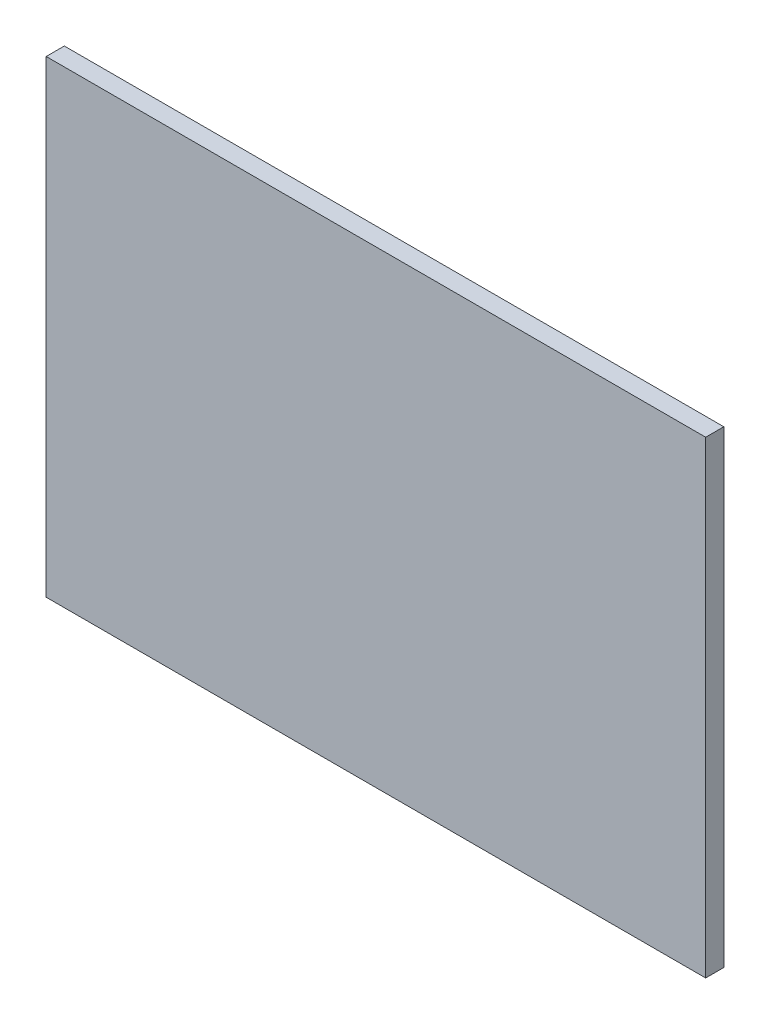
ISO-10303-21;
HEADER;
FILE_DESCRIPTION(('STEP AP214'),'2;1');
FILE_NAME('part.step','',(''),(''),'','','');
FILE_SCHEMA(('AUTOMOTIVE_DESIGN { 1 0 10303 214 1 1 1 1 }'));
ENDSEC;
DATA;
#1=APPLICATION_CONTEXT('core data for automotive mechanical design processes');
#2=APPLICATION_PROTOCOL_DEFINITION('international standard','automotive_design',2000,#1);
#3=PRODUCT_CONTEXT('',#1,'mechanical');
#4=PRODUCT('Part','Part','',(#3));
#5=PRODUCT_RELATED_PRODUCT_CATEGORY('part','',(#4));
#6=PRODUCT_DEFINITION_FORMATION('','',#4);
#7=PRODUCT_DEFINITION_CONTEXT('part definition',#1,'design');
#8=PRODUCT_DEFINITION('design','',#6,#7);
#9=PRODUCT_DEFINITION_SHAPE('','',#8);
#10=(LENGTH_UNIT() NAMED_UNIT(*) SI_UNIT(.MILLI.,.METRE.));
#11=(NAMED_UNIT(*) PLANE_ANGLE_UNIT() SI_UNIT($,.RADIAN.));
#12=(NAMED_UNIT(*) SI_UNIT($,.STERADIAN.) SOLID_ANGLE_UNIT());
#13=UNCERTAINTY_MEASURE_WITH_UNIT(LENGTH_MEASURE(1.E-05),#10,'distance_accuracy_value','');
#14=(GEOMETRIC_REPRESENTATION_CONTEXT(3) GLOBAL_UNCERTAINTY_ASSIGNED_CONTEXT((#13)) GLOBAL_UNIT_ASSIGNED_CONTEXT((#10,
#11,#12)) REPRESENTATION_CONTEXT('',''));
#15=CARTESIAN_POINT('',(0.,0.,0.));
#16=DIRECTION('',(0.,0.,1.));
#17=DIRECTION('',(1.,0.,0.));
#18=AXIS2_PLACEMENT_3D('',#15,#16,#17);
#19=CARTESIAN_POINT('',(-31.1136053155129,31.427314942792,-1.89738));
#20=DIRECTION('',(-1.,0.,0.));
#21=DIRECTION('',(0.,-1.,0.));
#22=AXIS2_PLACEMENT_3D('',#19,#20,#21);
#23=PLANE('',#22);
#24=DIRECTION('',(0.,-1.,0.));
#25=VECTOR('',#24,1.);
#26=CARTESIAN_POINT('',(-31.1136053155129,31.427314942792,0.));
#27=LINE('',#26,#25);
#28=CARTESIAN_POINT('',(-31.1136053155129,31.427314942792,0.));
#29=VERTEX_POINT('',#28);
#30=CARTESIAN_POINT('',(-31.1136053155129,-17.572685057208,0.));
#31=VERTEX_POINT('',#30);
#32=EDGE_CURVE('E99',#29,#31,#27,.T.);
#33=ORIENTED_EDGE('',*,*,#32,.F.);
#34=DIRECTION('',(0.,0.,1.));
#35=VECTOR('',#34,1.);
#36=CARTESIAN_POINT('',(-31.1136053155129,31.427314942792,-1.89738));
#37=LINE('',#36,#35);
#38=CARTESIAN_POINT('',(-31.1136053155129,31.427314942792,-1.89738));
#39=VERTEX_POINT('',#38);
#40=EDGE_CURVE('E11',#39,#29,#37,.T.);
#41=ORIENTED_EDGE('',*,*,#40,.F.);
#42=DIRECTION('',(0.,-1.,0.));
#43=VECTOR('',#42,1.);
#44=CARTESIAN_POINT('',(-31.1136053155129,31.427314942792,-1.89738));
#45=LINE('',#44,#43);
#46=CARTESIAN_POINT('',(-31.1136053155129,-17.572685057208,-1.89738));
#47=VERTEX_POINT('',#46);
#48=EDGE_CURVE('E93',#39,#47,#45,.T.);
#49=ORIENTED_EDGE('',*,*,#48,.T.);
#50=DIRECTION('',(0.,0.,1.));
#51=VECTOR('',#50,1.);
#52=CARTESIAN_POINT('',(-31.1136053155129,-17.572685057208,-1.89738));
#53=LINE('',#52,#51);
#54=EDGE_CURVE('E38',#47,#31,#53,.T.);
#55=ORIENTED_EDGE('',*,*,#54,.T.);
#56=EDGE_LOOP('',(#33,#41,#49,#55));
#57=FACE_BOUND('',#56,.T.);
#58=ADVANCED_FACE('F35',(#57),#23,.T.);
#59=CARTESIAN_POINT('',(-31.1136053155129,31.427314942792,-1.89738));
#60=DIRECTION('',(0.,1.,0.));
#61=DIRECTION('',(0.,0.,1.));
#62=AXIS2_PLACEMENT_3D('',#59,#60,#61);
#63=PLANE('',#62);
#64=DIRECTION('',(-1.,0.,0.));
#65=VECTOR('',#64,1.);
#66=CARTESIAN_POINT('',(-31.1136053155129,31.427314942792,0.));
#67=LINE('',#66,#65);
#68=CARTESIAN_POINT('',(37.8863946844871,31.427314942792,0.));
#69=VERTEX_POINT('',#68);
#70=EDGE_CURVE('E95',#69,#29,#67,.T.);
#71=ORIENTED_EDGE('',*,*,#70,.F.);
#72=DIRECTION('',(0.,0.,1.));
#73=VECTOR('',#72,1.);
#74=CARTESIAN_POINT('',(37.8863946844871,31.427314942792,-1.89738));
#75=LINE('',#74,#73);
#76=CARTESIAN_POINT('',(37.8863946844871,31.427314942792,-1.89738));
#77=VERTEX_POINT('',#76);
#78=EDGE_CURVE('E44',#77,#69,#75,.T.);
#79=ORIENTED_EDGE('',*,*,#78,.F.);
#80=DIRECTION('',(-1.,0.,0.));
#81=VECTOR('',#80,1.);
#82=CARTESIAN_POINT('',(-31.1136053155129,31.427314942792,-1.89738));
#83=LINE('',#82,#81);
#84=EDGE_CURVE('E90',#77,#39,#83,.T.);
#85=ORIENTED_EDGE('',*,*,#84,.T.);
#86=ORIENTED_EDGE('',*,*,#40,.T.);
#87=EDGE_LOOP('',(#71,#79,#85,#86));
#88=FACE_BOUND('',#87,.T.);
#89=ADVANCED_FACE('F109',(#88),#63,.T.);
#90=CARTESIAN_POINT('',(37.8863946844871,31.427314942792,-1.89738));
#91=DIRECTION('',(1.,0.,0.));
#92=DIRECTION('',(0.,1.,0.));
#93=AXIS2_PLACEMENT_3D('',#90,#91,#92);
#94=PLANE('',#93);
#95=DIRECTION('',(0.,1.,0.));
#96=VECTOR('',#95,1.);
#97=CARTESIAN_POINT('',(37.8863946844871,31.427314942792,0.));
#98=LINE('',#97,#96);
#99=CARTESIAN_POINT('',(37.8863946844871,-17.572685057208,0.));
#100=VERTEX_POINT('',#99);
#101=EDGE_CURVE('E85',#100,#69,#98,.T.);
#102=ORIENTED_EDGE('',*,*,#101,.F.);
#103=DIRECTION('',(0.,0.,1.));
#104=VECTOR('',#103,1.);
#105=CARTESIAN_POINT('',(37.8863946844871,-17.572685057208,-1.89738));
#106=LINE('',#105,#104);
#107=CARTESIAN_POINT('',(37.8863946844871,-17.572685057208,-1.89738));
#108=VERTEX_POINT('',#107);
#109=EDGE_CURVE('E80',#108,#100,#106,.T.);
#110=ORIENTED_EDGE('',*,*,#109,.F.);
#111=DIRECTION('',(0.,1.,0.));
#112=VECTOR('',#111,1.);
#113=CARTESIAN_POINT('',(37.8863946844871,31.427314942792,-1.89738));
#114=LINE('',#113,#112);
#115=EDGE_CURVE('E83',#108,#77,#114,.T.);
#116=ORIENTED_EDGE('',*,*,#115,.T.);
#117=ORIENTED_EDGE('',*,*,#78,.T.);
#118=EDGE_LOOP('',(#102,#110,#116,#117));
#119=FACE_BOUND('',#118,.T.);
#120=ADVANCED_FACE('F82',(#119),#94,.T.);
#121=CARTESIAN_POINT('',(-31.1136053155129,-17.572685057208,-1.89738));
#122=DIRECTION('',(0.,-1.,0.));
#123=DIRECTION('',(0.,0.,-1.));
#124=AXIS2_PLACEMENT_3D('',#121,#122,#123);
#125=PLANE('',#124);
#126=DIRECTION('',(1.,0.,0.));
#127=VECTOR('',#126,1.);
#128=CARTESIAN_POINT('',(-31.1136053155129,-17.572685057208,0.));
#129=LINE('',#128,#127);
#130=EDGE_CURVE('E102',#31,#100,#129,.T.);
#131=ORIENTED_EDGE('',*,*,#130,.F.);
#132=ORIENTED_EDGE('',*,*,#54,.F.);
#133=DIRECTION('',(1.,0.,0.));
#134=VECTOR('',#133,1.);
#135=CARTESIAN_POINT('',(-31.1136053155129,-17.572685057208,-1.89738));
#136=LINE('',#135,#134);
#137=EDGE_CURVE('E89',#47,#108,#136,.T.);
#138=ORIENTED_EDGE('',*,*,#137,.T.);
#139=ORIENTED_EDGE('',*,*,#109,.T.);
#140=EDGE_LOOP('',(#131,#132,#138,#139));
#141=FACE_BOUND('',#140,.T.);
#142=ADVANCED_FACE('F92',(#141),#125,.T.);
#143=CARTESIAN_POINT('',(0.,0.,-1.89738));
#144=DIRECTION('',(0.,0.,1.));
#145=DIRECTION('',(1.,0.,0.));
#146=AXIS2_PLACEMENT_3D('',#143,#144,#145);
#147=PLANE('',#146);
#148=ORIENTED_EDGE('',*,*,#48,.F.);
#149=ORIENTED_EDGE('',*,*,#84,.F.);
#150=ORIENTED_EDGE('',*,*,#115,.F.);
#151=ORIENTED_EDGE('',*,*,#137,.F.);
#152=EDGE_LOOP('',(#148,#149,#150,#151));
#153=FACE_BOUND('',#152,.T.);
#154=ADVANCED_FACE('F88',(#153),#147,.F.);
#155=CARTESIAN_POINT('',(0.,0.,0.));
#156=DIRECTION('',(0.,0.,1.));
#157=DIRECTION('',(1.,0.,0.));
#158=AXIS2_PLACEMENT_3D('',#155,#156,#157);
#159=PLANE('',#158);
#160=ORIENTED_EDGE('',*,*,#32,.T.);
#161=ORIENTED_EDGE('',*,*,#130,.T.);
#162=ORIENTED_EDGE('',*,*,#101,.T.);
#163=ORIENTED_EDGE('',*,*,#70,.T.);
#164=EDGE_LOOP('',(#160,#161,#162,#163));
#165=FACE_BOUND('',#164,.T.);
#166=ADVANCED_FACE('F108',(#165),#159,.T.);
#167=CLOSED_SHELL('',(#58,#89,#120,#142,#154,#166));
#168=MANIFOLD_SOLID_BREP('B2',#167);
#169=ADVANCED_BREP_SHAPE_REPRESENTATION('',(#18,#168),#14);
#170=SHAPE_DEFINITION_REPRESENTATION(#9,#169);
ENDSEC;
END-ISO-10303-21;
